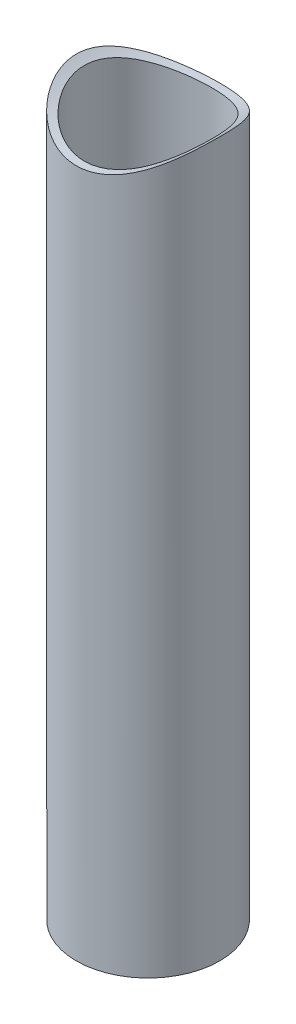
ISO-10303-21;
HEADER;
FILE_DESCRIPTION(('STEP AP214'),'2;1');
FILE_NAME('part.step','',(''),(''),'','','');
FILE_SCHEMA(('AUTOMOTIVE_DESIGN { 1 0 10303 214 1 1 1 1 }'));
ENDSEC;
DATA;
#1=APPLICATION_CONTEXT('core data for automotive mechanical design processes');
#2=APPLICATION_PROTOCOL_DEFINITION('international standard','automotive_design',2000,#1);
#3=PRODUCT_CONTEXT('',#1,'mechanical');
#4=PRODUCT('Part','Part','',(#3));
#5=PRODUCT_RELATED_PRODUCT_CATEGORY('part','',(#4));
#6=PRODUCT_DEFINITION_FORMATION('','',#4);
#7=PRODUCT_DEFINITION_CONTEXT('part definition',#1,'design');
#8=PRODUCT_DEFINITION('design','',#6,#7);
#9=PRODUCT_DEFINITION_SHAPE('','',#8);
#10=(LENGTH_UNIT() NAMED_UNIT(*) SI_UNIT(.MILLI.,.METRE.));
#11=(NAMED_UNIT(*) PLANE_ANGLE_UNIT() SI_UNIT($,.RADIAN.));
#12=(NAMED_UNIT(*) SI_UNIT($,.STERADIAN.) SOLID_ANGLE_UNIT());
#13=UNCERTAINTY_MEASURE_WITH_UNIT(LENGTH_MEASURE(1.E-05),#10,'distance_accuracy_value','');
#14=(GEOMETRIC_REPRESENTATION_CONTEXT(3) GLOBAL_UNCERTAINTY_ASSIGNED_CONTEXT((#13)) GLOBAL_UNIT_ASSIGNED_CONTEXT((#10,
#11,#12)) REPRESENTATION_CONTEXT('',''));
#15=CARTESIAN_POINT('',(0.,0.,0.));
#16=DIRECTION('',(0.,0.,1.));
#17=DIRECTION('',(1.,0.,0.));
#18=AXIS2_PLACEMENT_3D('',#15,#16,#17);
#19=CARTESIAN_POINT('',(0.,0.,0.));
#20=DIRECTION('',(0.,1.,0.));
#21=DIRECTION('',(0.,0.,1.));
#22=AXIS2_PLACEMENT_3D('',#19,#20,#21);
#23=PLANE('',#22);
#24=CARTESIAN_POINT('',(0.,0.,0.));
#25=DIRECTION('',(0.,1.,0.));
#26=DIRECTION('',(0.,0.,1.));
#27=AXIS2_PLACEMENT_3D('',#24,#25,#26);
#28=CIRCLE('',#27,7.9375);
#29=CARTESIAN_POINT('',(0.,0.,7.9375));
#30=VERTEX_POINT('',#29);
#31=EDGE_CURVE('E10',#30,#30,#28,.T.);
#32=ORIENTED_EDGE('',*,*,#31,.F.);
#33=EDGE_LOOP('',(#32));
#34=FACE_BOUND('',#33,.T.);
#35=CARTESIAN_POINT('',(0.,0.,0.));
#36=DIRECTION('',(0.,1.,0.));
#37=DIRECTION('',(0.,0.,1.));
#38=AXIS2_PLACEMENT_3D('',#35,#36,#37);
#39=CIRCLE('',#38,7.0485);
#40=CARTESIAN_POINT('',(0.,0.,7.0485));
#41=VERTEX_POINT('',#40);
#42=EDGE_CURVE('E46',#41,#41,#39,.T.);
#43=ORIENTED_EDGE('',*,*,#42,.T.);
#44=EDGE_LOOP('',(#43));
#45=FACE_BOUND('',#44,.T.);
#46=ADVANCED_FACE('F32',(#34,#45),#23,.F.);
#47=CARTESIAN_POINT('',(0.,88.9,0.));
#48=DIRECTION('',(0.,-1.,0.));
#49=DIRECTION('',(0.,0.,-1.));
#50=AXIS2_PLACEMENT_3D('',#47,#48,#49);
#51=CYLINDRICAL_SURFACE('',#50,7.9375);
#52=CARTESIAN_POINT('',(0.,76.2,-7.9375));
#53=CARTESIAN_POINT('',(0.201739041368471,76.2000004728503,-7.93749953499278));
#54=CARTESIAN_POINT('',(0.403488446576434,76.2048176230355,-7.92979870263526));
#55=CARTESIAN_POINT('',(0.805443060018179,76.2239686766591,-7.8991023844576));
#56=CARTESIAN_POINT('',(1.00564755898276,76.2383067154746,-7.87610025254355));
#57=CARTESIAN_POINT('',(1.40315814184426,76.2761706444708,-7.81508453956653));
#58=CARTESIAN_POINT('',(1.60045973896419,76.29970946626,-7.77704982952283));
#59=CARTESIAN_POINT('',(1.99053521067712,76.35541520527,-7.68646789068216));
#60=CARTESIAN_POINT('',(2.18330713262609,76.3875857718404,-7.63391452337359));
#61=CARTESIAN_POINT('',(2.56196376123141,76.4596106743845,-7.51527787325432));
#62=CARTESIAN_POINT('',(2.74788019033168,76.499422324321,-7.44926963308425));
#63=CARTESIAN_POINT('',(3.11296282478007,76.5859965712949,-7.3042433100681));
#64=CARTESIAN_POINT('',(3.29212638199121,76.6327618603719,-7.22522018734493));
#65=CARTESIAN_POINT('',(3.64269021438579,76.7322566825764,-7.0549739217575));
#66=CARTESIAN_POINT('',(3.81409509912127,76.7849826074947,-6.9637581535496));
#67=CARTESIAN_POINT('',(4.14861337783257,76.895413876922,-6.76981016401713));
#68=CARTESIAN_POINT('',(4.31172367627709,76.9531210590714,-6.66707368836082));
#69=CARTESIAN_POINT('',(4.81294866145539,77.1416342205612,-6.32543868247448));
#70=CARTESIAN_POINT('',(5.13503247600621,77.279717024903,-6.06661079060302));
#71=CARTESIAN_POINT('',(5.73404632799171,77.5632987111826,-5.50398780175486));
#72=CARTESIAN_POINT('',(6.01091462379353,77.7088073833193,-5.20013228125319));
#73=CARTESIAN_POINT('',(6.40636593989623,77.9329730937884,-4.69220024274917));
#74=CARTESIAN_POINT('',(6.54167320119787,78.0133657375114,-4.50169520891753));
#75=CARTESIAN_POINT('',(6.79568677227649,78.1700936295657,-4.10820920027474));
#76=CARTESIAN_POINT('',(6.91438997276443,78.2464281163087,-3.90522589899065));
#77=CARTESIAN_POINT('',(7.13401347491112,78.3922307030232,-3.4878780265806));
#78=CARTESIAN_POINT('',(7.23495774013726,78.461707999474,-3.27352930831123));
#79=CARTESIAN_POINT('',(7.41807462208145,78.5910357341303,-2.83419265944875));
#80=CARTESIAN_POINT('',(7.50025500789233,78.6508901535928,-2.60920917887078));
#81=CARTESIAN_POINT('',(7.62583887352565,78.7441636877437,-2.20958661829698));
#82=CARTESIAN_POINT('',(7.67377170148966,78.7804130963919,-2.03702003937505));
#83=CARTESIAN_POINT('',(7.75809620793248,78.8449133539286,-1.68763804361595));
#84=CARTESIAN_POINT('',(7.79449068321333,78.8731661409543,-1.51082366760551));
#85=CARTESIAN_POINT('',(7.85522342720327,78.9206736015007,-1.15414787294094));
#86=CARTESIAN_POINT('',(7.87957575318649,78.9399387651334,-0.974290261753216));
#87=CARTESIAN_POINT('',(7.91591648836484,78.9687961956645,-0.612546165554987));
#88=CARTESIAN_POINT('',(7.92790472814816,78.9783883300237,-0.430659652779134));
#89=CARTESIAN_POINT('',(7.93933187604833,78.9875298269265,-0.0657552660776738));
#90=CARTESIAN_POINT('',(7.93873752495498,78.9870525733501,0.117264327578585));
#91=CARTESIAN_POINT('',(7.92492809864643,78.976009331337,0.482517284842522));
#92=CARTESIAN_POINT('',(7.91171295819187,78.9654432907493,0.664750644381109));
#93=CARTESIAN_POINT('',(7.87286806727876,78.9346320399462,1.02717928073088));
#94=CARTESIAN_POINT('',(7.84722972621482,78.914380132109,1.2073730588109));
#95=CARTESIAN_POINT('',(7.78392567936421,78.8649560254577,1.56437831658882));
#96=CARTESIAN_POINT('',(7.74625970951021,78.8357836307944,1.74118972193616));
#97=CARTESIAN_POINT('',(7.66040790802239,78.7702916677712,2.08637284954481));
#98=CARTESIAN_POINT('',(7.61248647387731,78.7341536594987,2.25484520669524));
#99=CARTESIAN_POINT('',(7.50614440051444,78.6553833255514,2.58691330612416));
#100=CARTESIAN_POINT('',(7.44772020514098,78.6127488009525,2.75050737470939));
#101=CARTESIAN_POINT('',(7.25747941686762,78.4767904967193,3.23301636146897));
#102=CARTESIAN_POINT('',(7.11065079582381,78.3753771084986,3.54383146007847));
#103=CARTESIAN_POINT('',(6.74968610006634,78.1395963706601,4.19637403936481));
#104=CARTESIAN_POINT('',(6.52810038196324,78.002611997526,4.53302972024284));
#105=CARTESIAN_POINT('',(6.16066831196552,77.7934174575325,5.00902431475109));
#106=CARTESIAN_POINT('',(6.03223324047688,77.7230091294348,5.16296792737679));
#107=CARTESIAN_POINT('',(5.76399717035518,77.5823482175808,5.46080602972515));
#108=CARTESIAN_POINT('',(5.6241941730042,77.512095663453,5.60469874398706));
#109=CARTESIAN_POINT('',(5.30963244227627,77.3616716356376,5.90478278495736));
#110=CARTESIAN_POINT('',(5.13291711894878,77.2817820441986,6.05907031904445));
#111=CARTESIAN_POINT('',(4.76542385358572,77.1262781901502,6.35215327111168));
#112=CARTESIAN_POINT('',(4.57465109506246,77.0506623696328,6.49095435254102));
#113=CARTESIAN_POINT('',(4.17980536221483,76.9056908426482,6.75197270825118));
#114=CARTESIAN_POINT('',(3.97573221613199,76.8363352170516,6.87418976830651));
#115=CARTESIAN_POINT('',(3.55537666295463,76.7058330773724,7.10071717435151));
#116=CARTESIAN_POINT('',(3.33909570840597,76.6446855895573,7.20502964477509));
#117=CARTESIAN_POINT('',(2.90769946998035,76.5354504352621,7.38926185561915));
#118=CARTESIAN_POINT('',(2.6931507971941,76.4868361700353,7.47019396643397));
#119=CARTESIAN_POINT('',(2.25592151368444,76.3999809088183,7.61364865613235));
#120=CARTESIAN_POINT('',(2.03324105404608,76.3617397202119,7.67617157685525));
#121=CARTESIAN_POINT('',(1.58191912498485,76.2968478898773,7.78171449981311));
#122=CARTESIAN_POINT('',(1.35328499373077,76.2701836349815,7.82475741087987));
#123=CARTESIAN_POINT('',(0.892040639280498,76.2292528769654,7.89065342723416));
#124=CARTESIAN_POINT('',(0.65943110221138,76.2149842560458,7.91350998138035));
#125=CARTESIAN_POINT('',(0.227391919887281,76.2004784067146,7.93673818597211));
#126=CARTESIAN_POINT('',(0.0281675793366315,76.1984713662277,7.93994609714297));
#127=CARTESIAN_POINT('',(-0.369831100816882,76.2038266503345,7.93137681681763));
#128=CARTESIAN_POINT('',(-0.568605462587634,76.2111885028502,7.91960038034993));
#129=CARTESIAN_POINT('',(-0.964132789286348,76.2350994719283,7.88123309303378));
#130=CARTESIAN_POINT('',(-1.16088594911878,76.2516476940162,7.85464368451963));
#131=CARTESIAN_POINT('',(-1.55093994632036,76.2935309779087,7.78701944038209));
#132=CARTESIAN_POINT('',(-1.74424072273741,76.3188661946874,7.74598434998349));
#133=CARTESIAN_POINT('',(-2.11853172321314,76.3765715441998,7.65189452223095));
#134=CARTESIAN_POINT('',(-2.29970680807441,76.4086248555062,7.59937759450793));
#135=CARTESIAN_POINT('',(-2.65669551879437,76.4796494719918,7.4820580460772));
#136=CARTESIAN_POINT('',(-2.83250739477919,76.518623007358,7.41725146431225));
#137=CARTESIAN_POINT('',(-3.17781013983771,76.6027205634715,7.27600236673));
#138=CARTESIAN_POINT('',(-3.34730273526276,76.6478428885294,7.19956305826494));
#139=CARTESIAN_POINT('',(-3.67934207474231,76.743423781947,7.03567096646305));
#140=CARTESIAN_POINT('',(-3.84188626721929,76.7938842873439,6.94821418306189));
#141=CARTESIAN_POINT('',(-4.35009370138634,76.962582635168,6.6516260703067));
#142=CARTESIAN_POINT('',(-4.6814389192328,77.0894908638651,6.42242187998982));
#143=CARTESIAN_POINT('',(-5.30323518058702,77.3552895109652,5.91945435068259));
#144=CARTESIAN_POINT('',(-5.59364011807453,77.494193159013,5.64564151048665));
#145=CARTESIAN_POINT('',(-6.01533332752689,77.7135888003975,5.18377492062231));
#146=CARTESIAN_POINT('',(-6.16161637869311,77.793697223221,5.00902405345219));
#147=CARTESIAN_POINT('',(-6.43897528209487,77.9521628069094,4.64709912372846));
#148=CARTESIAN_POINT('',(-6.57004856143535,78.0305196696745,4.45992296769909));
#149=CARTESIAN_POINT('',(-6.93914755260477,78.2594310964116,3.8808997644976));
#150=CARTESIAN_POINT('',(-7.15355254202931,78.4040987850596,3.47101162945262));
#151=CARTESIAN_POINT('',(-7.47302041242335,78.6299373668107,2.7005893680761));
#152=CARTESIAN_POINT('',(-7.59158257265493,78.7180616897492,2.34772073021857));
#153=CARTESIAN_POINT('',(-7.73201627349787,78.8248176017812,1.80413256207854));
#154=CARTESIAN_POINT('',(-7.77258572070265,78.8561586318446,1.62061541729438));
#155=CARTESIAN_POINT('',(-7.84075654091829,78.90928264009,1.24977975093963));
#156=CARTESIAN_POINT('',(-7.86835795400166,78.9310656478073,1.06246124111749));
#157=CARTESIAN_POINT('',(-7.9102480110533,78.964271736675,0.684312945446909));
#158=CARTESIAN_POINT('',(-7.92445839109539,78.9756339030027,0.49346908369362));
#159=CARTESIAN_POINT('',(-7.93903274223715,78.9872884623143,0.110909988366785));
#160=CARTESIAN_POINT('',(-7.93939677439559,78.9875809041128,-0.0808052413605291));
#161=CARTESIAN_POINT('',(-7.92626891419433,78.9770806249616,-0.463508329200532));
#162=CARTESIAN_POINT('',(-7.91277281233079,78.9662845362802,-0.654495948641016));
#163=CARTESIAN_POINT('',(-7.87216544677196,78.9340741560227,-1.0340978913042));
#164=CARTESIAN_POINT('',(-7.84505437516811,78.9126600142551,-1.22271224797241));
#165=CARTESIAN_POINT('',(-7.78039679661611,78.8622235161899,-1.58105941210101));
#166=CARTESIAN_POINT('',(-7.74387197931695,78.8339568354482,-1.7510852712605));
#167=CARTESIAN_POINT('',(-7.66015013960237,78.7701004392687,-2.08710799889913));
#168=CARTESIAN_POINT('',(-7.61294955828487,78.734508282147,-2.25310350332707));
#169=CARTESIAN_POINT('',(-7.45605656918077,78.6182591821347,-2.74389938558109));
#170=CARTESIAN_POINT('',(-7.33104170015385,78.5281040556078,-3.06167864250887));
#171=CARTESIAN_POINT('',(-7.02326627827775,78.3168381382484,-3.71858241310545));
#172=CARTESIAN_POINT('',(-6.83476595879601,78.1931353921583,-4.05413685229279));
#173=CARTESIAN_POINT('',(-6.41347152197481,77.9355886042432,-4.69228119333398));
#174=CARTESIAN_POINT('',(-6.18064159435185,77.8017364164789,-4.99484413111009));
#175=CARTESIAN_POINT('',(-5.77569391220568,77.5880191676203,-5.44952756406373));
#176=CARTESIAN_POINT('',(-5.61660064645281,77.5079995358034,-5.61337366376787));
#177=CARTESIAN_POINT('',(-5.28426957717029,77.3500949556796,-5.92727854331289));
#178=CARTESIAN_POINT('',(-5.1110305203805,77.2722101973322,-6.07733609903576));
#179=CARTESIAN_POINT('',(-4.75098347114556,77.1205114461951,-6.36277262458991));
#180=CARTESIAN_POINT('',(-4.56416691225762,77.0467000760013,-6.49814219070813));
#181=CARTESIAN_POINT('',(-4.17780989523751,76.9050748014364,-6.75302630476872));
#182=CARTESIAN_POINT('',(-3.97826817197835,76.8372614949933,-6.87253927260913));
#183=CARTESIAN_POINT('',(-3.56704578084192,76.7093214771334,-7.09470320989308));
#184=CARTESIAN_POINT('',(-3.35534036839002,76.649211300305,-7.19731803802598));
#185=CARTESIAN_POINT('',(-2.92162024534505,76.538601363087,-7.38401902310277));
#186=CARTESIAN_POINT('',(-2.69961157936524,76.4880960542981,-7.46811588169563));
#187=CARTESIAN_POINT('',(-2.24750287628487,76.3983321630288,-7.61636899488247));
#188=CARTESIAN_POINT('',(-2.01742652180656,76.3590433258491,-7.68057893190415));
#189=CARTESIAN_POINT('',(-1.55084845588795,76.2928471272961,-7.78819732114139));
#190=CARTESIAN_POINT('',(-1.31435162007781,76.265930634478,-7.83162111561288));
#191=CARTESIAN_POINT('',(-0.898061516717918,76.2305338897998,-7.8885756236326));
#192=CARTESIAN_POINT('',(-0.719156625233639,76.2191048929041,-7.90690173667894));
#193=CARTESIAN_POINT('',(-0.360170623508275,76.2038375020409,-7.93136450964792));
#194=CARTESIAN_POINT('',(-0.180089441157222,76.1999995778936,-7.93750041510503));
#195=CARTESIAN_POINT('',(0.,76.2,-7.9375));
#196=B_SPLINE_CURVE_WITH_KNOTS('',3,(#52,#53,#54,#55,#56,#57,#58,#59,#60,#61,#62,#63,#64,#65,
#66,#67,#68,#69,#70,#71,#72,#73,#74,#75,#76,#77,#78,#79,#80,#81,#82,#83,#84,#85,#86,#87,#88,#89,
#90,#91,#92,#93,#94,#95,#96,#97,#98,#99,#100,#101,#102,#103,#104,#105,#106,#107,#108,#109,#110,
#111,#112,#113,#114,#115,#116,#117,#118,#119,#120,#121,#122,#123,#124,#125,#126,#127,#128,#129,
#130,#131,#132,#133,#134,#135,#136,#137,#138,#139,#140,#141,#142,#143,#144,#145,#146,#147,#148,
#149,#150,#151,#152,#153,#154,#155,#156,#157,#158,#159,#160,#161,#162,#163,#164,#165,#166,#167,
#168,#169,#170,#171,#172,#173,#174,#175,#176,#177,#178,#179,#180,#181,#182,#183,#184,#185,#186,
#187,#188,#189,#190,#191,#192,#193,#194,#195),.UNSPECIFIED.,.T.,.F.,(4,2,2,2,2,2,2,2,2,2,2,2,2,
2,2,2,2,2,2,2,2,2,2,2,2,2,2,2,2,2,2,2,2,2,2,2,2,2,2,2,2,2,2,2,2,2,2,2,2,2,2,2,2,2,2,2,2,2,2,2,2,
2,2,2,2,2,2,2,2,2,2,4),(0.,0.605032466965532,1.21032790051417,1.81647714760341,2.42288306882269,
3.0259951020022,3.62934123551352,4.23232407584534,4.83553032169086,6.13713310641447,
7.44049862716951,8.181056339442,8.92175254399169,9.66144147049492,10.4008235747676,
10.9484871921508,11.4960179586916,12.0429080532745,12.5898056412066,13.1381490082851,
13.6864952098747,14.2352211334837,14.7839591052322,15.319963521766,15.8561497683577,
16.9279807748438,18.2000370601928,18.8370734993811,19.4742221860236,20.2167821016984,
20.9590695643509,21.7013666146512,22.4435755281765,23.1457425675394,23.8478965675749,
24.5492226627341,25.2504289124566,25.8474483559121,26.4444377180554,27.0413689616944,
27.6383107338014,28.2117120916599,28.7852985766026,29.3587271989932,29.9323646167724,
31.1943593027149,32.4577640553729,33.1817121045419,33.9057824392656,35.3515833534236,
36.4943111364462,37.0653170546956,37.6363212084685,38.2106422690401,38.7849607970061,
39.3594538046143,39.9339387070196,40.4619467685538,40.990131108421,42.0459823290161,
43.2546905874606,44.4643794378768,45.1896481558809,45.9149811996373,46.6407759178751,
47.3666429069534,48.0940427464342,48.8210211073283,49.5460196181382,50.2704821791066,
50.8105522373992,51.3506557201891),.UNSPECIFIED.);
#197=CARTESIAN_POINT('',(0.,76.2,-7.9375));
#198=VERTEX_POINT('',#197);
#199=EDGE_CURVE('E50',#198,#198,#196,.T.);
#200=ORIENTED_EDGE('',*,*,#199,.T.);
#201=EDGE_LOOP('',(#200));
#202=FACE_BOUND('',#201,.T.);
#203=ORIENTED_EDGE('',*,*,#31,.T.);
#204=EDGE_LOOP('',(#203));
#205=FACE_BOUND('',#204,.T.);
#206=ADVANCED_FACE('F34',(#202,#205),#51,.T.);
#207=CARTESIAN_POINT('',(0.,88.9,0.));
#208=DIRECTION('',(0.,-1.,0.));
#209=DIRECTION('',(0.,0.,-1.));
#210=AXIS2_PLACEMENT_3D('',#207,#208,#209);
#211=CYLINDRICAL_SURFACE('',#210,7.0485);
#212=CARTESIAN_POINT('',(0.,76.2,-7.0485));
#213=CARTESIAN_POINT('',(0.182941782201594,76.1999995337118,-7.04850053218535));
#214=CARTESIAN_POINT('',(0.365876640929528,76.2039612400593,-7.04137003165967));
#215=CARTESIAN_POINT('',(0.730294252396065,76.2197031424221,-7.01294668502501));
#216=CARTESIAN_POINT('',(0.911777077194873,76.2314829479817,-6.99165454618426));
#217=CARTESIAN_POINT('',(1.27193540988049,76.2625612354059,-6.9351831702809));
#218=CARTESIAN_POINT('',(1.45061050347653,76.2818608162016,-6.90000190346731));
#219=CARTESIAN_POINT('',(1.80385191140284,76.3274965879735,-6.81618865333209));
#220=CARTESIAN_POINT('',(1.97841813228534,76.3538329388185,-6.76755636441503));
#221=CARTESIAN_POINT('',(2.32163162018639,76.4127978779366,-6.65760589447952));
#222=CARTESIAN_POINT('',(2.49029954854185,76.445401193601,-6.59633859631463));
#223=CARTESIAN_POINT('',(2.82150382584187,76.516226376835,-6.46161506944264));
#224=CARTESIAN_POINT('',(2.98403783362248,76.5544503629571,-6.38815424337956));
#225=CARTESIAN_POINT('',(3.46105509495003,76.676312349381,-6.15048901422132));
#226=CARTESIAN_POINT('',(3.76521927053737,76.7671879838532,-5.96891569303088));
#227=CARTESIAN_POINT('',(4.36048084642938,76.9676201842259,-5.55059035793831));
#228=CARTESIAN_POINT('',(4.64920365112904,77.0780358236694,-5.31088194942437));
#229=CARTESIAN_POINT('',(5.05052633040185,77.2465297779373,-4.92021262114861));
#230=CARTESIAN_POINT('',(5.17909977106984,77.3032207382781,-4.78468054011419));
#231=CARTESIAN_POINT('',(5.42519989944967,77.4162933810141,-4.50371208145303));
#232=CARTESIAN_POINT('',(5.54272468772968,77.4726750086673,-4.35827400821953));
#233=CARTESIAN_POINT('',(5.77744314566941,77.5893839748413,-4.04289078349403));
#234=CARTESIAN_POINT('',(5.89339755452663,77.6495325311888,-3.87195544698546));
#235=CARTESIAN_POINT('',(6.11037250424153,77.7658856237672,-3.51958792215367));
#236=CARTESIAN_POINT('',(6.21139435903687,77.822090506779,-3.33815665933963));
#237=CARTESIAN_POINT('',(6.39751990684712,77.9285267119067,-2.96586507972635));
#238=CARTESIAN_POINT('',(6.48264034786683,77.9787642984693,-2.77501495424503));
#239=CARTESIAN_POINT('',(6.63609519143386,78.071321268448,-2.3848481125914));
#240=CARTESIAN_POINT('',(6.70443468489977,78.1136430523891,-2.18553398576128));
#241=CARTESIAN_POINT('',(6.81086470731331,78.1806158005084,-1.82246439225638));
#242=CARTESIAN_POINT('',(6.85229340782435,78.2071112668412,-1.66002090354711));
#243=CARTESIAN_POINT('',(6.9236002127798,78.2531428357821,-1.33166155942276));
#244=CARTESIAN_POINT('',(6.95348063051376,78.2726803321117,-1.16574640645933));
#245=CARTESIAN_POINT('',(7.00130117595196,78.3041232844713,-0.831620298326207));
#246=CARTESIAN_POINT('',(7.01925094782589,78.3160349046115,-0.663411309918094));
#247=CARTESIAN_POINT('',(7.04300215811528,78.331824835043,-0.325753279202885));
#248=CARTESIAN_POINT('',(7.04880334183828,78.3357029769141,-0.156304210972523));
#249=CARTESIAN_POINT('',(7.04817186670077,78.3352816657665,0.182742882353627));
#250=CARTESIAN_POINT('',(7.04172605917906,78.3309734236507,0.352340871924084));
#251=CARTESIAN_POINT('',(7.01666818097641,78.31432139298,0.690233052741045));
#252=CARTESIAN_POINT('',(6.9980560699555,78.3019775777814,0.858527239662642));
#253=CARTESIAN_POINT('',(6.94891341921106,78.2696913039814,1.1926799838333));
#254=CARTESIAN_POINT('',(6.91837861204685,78.2497461247169,1.3585376469074));
#255=CARTESIAN_POINT('',(6.84576115929665,78.2029248535566,1.68676453249707));
#256=CARTESIAN_POINT('',(6.80367387325666,78.1760459767625,1.84913232486384));
#257=CARTESIAN_POINT('',(6.7084233484212,78.1162059153318,2.16940443279372));
#258=CARTESIAN_POINT('',(6.65526158987377,78.0832455436338,2.32730934167939));
#259=CARTESIAN_POINT('',(6.53834776308593,78.0121772376892,2.63797828881369));
#260=CARTESIAN_POINT('',(6.47459220533038,77.9740676080925,2.7907406131296));
#261=CARTESIAN_POINT('',(6.26819340087044,77.8535002317934,3.24034173580869));
#262=CARTESIAN_POINT('',(6.11037040587854,77.7647727825211,3.52865284733548));
#263=CARTESIAN_POINT('',(5.73109004792924,77.5643420679675,4.12037904114517));
#264=CARTESIAN_POINT('',(5.50361170751932,77.4511951481124,4.41945232870603));
#265=CARTESIAN_POINT('',(5.12933501359428,77.2811005818999,4.8380154106562));
#266=CARTESIAN_POINT('',(4.99896031729076,77.224298946489,4.97261479799116));
#267=CARTESIAN_POINT('',(4.72759672288195,77.1118120293967,5.23128137646062));
#268=CARTESIAN_POINT('',(4.58660609464981,77.0561269315633,5.3553468437936));
#269=CARTESIAN_POINT('',(4.27979717790139,76.9416222731503,5.6042455740198));
#270=CARTESIAN_POINT('',(4.11291088025142,76.8830571167859,5.72788199172881));
#271=CARTESIAN_POINT('',(3.76788017636557,76.7704497147615,5.96051145371805));
#272=CARTESIAN_POINT('',(3.58974046105845,76.7164056060779,6.06951054103736));
#273=CARTESIAN_POINT('',(3.22318305025424,76.6143468935572,6.27186224504223));
#274=CARTESIAN_POINT('',(3.03476789881471,76.5663308068982,6.36521871152545));
#275=CARTESIAN_POINT('',(2.64886963137842,76.4777352694938,6.53523373903351));
#276=CARTESIAN_POINT('',(2.45138762156283,76.4371549145682,6.61189433048012));
#277=CARTESIAN_POINT('',(2.06315232755182,76.3672627082515,6.74267658554425));
#278=CARTESIAN_POINT('',(1.8729147004327,76.3373559047221,6.79801091143738));
#279=CARTESIAN_POINT('',(1.48737392655304,76.2858996602948,6.89263806310568));
#280=CARTESIAN_POINT('',(1.29207097912715,76.2643498910547,6.93193151911871));
#281=CARTESIAN_POINT('',(0.898209256778737,76.2302618965338,6.99387479603163));
#282=CARTESIAN_POINT('',(0.699652979838059,76.2177170608265,7.01653682615953));
#283=CARTESIAN_POINT('',(0.300970291596672,76.202000177323,7.04490556325498));
#284=CARTESIAN_POINT('',(0.100844035962402,76.1988272117759,7.05061393042914));
#285=CARTESIAN_POINT('',(-0.276418689729305,76.2017696284542,7.0453107272255));
#286=CARTESIAN_POINT('',(-0.453592031298103,76.2068738042347,7.03611946978441));
#287=CARTESIAN_POINT('',(-0.806384587513013,76.2243962527775,7.00445986014873));
#288=CARTESIAN_POINT('',(-0.982003815591317,76.236814462262,6.98199162282097));
#289=CARTESIAN_POINT('',(-1.33042363387744,76.2686667777585,6.9240534042135));
#290=CARTESIAN_POINT('',(-1.50322432851009,76.2881006232258,6.8885839057702));
#291=CARTESIAN_POINT('',(-1.8448692229325,76.3335302959283,6.80505252036323));
#292=CARTESIAN_POINT('',(-2.01371329451065,76.3595263354862,6.75699022595185));
#293=CARTESIAN_POINT('',(-2.3458047556138,76.4173922632361,6.64897903503995));
#294=CARTESIAN_POINT('',(-2.50907062295386,76.44923994839,6.58907500682509));
#295=CARTESIAN_POINT('',(-2.82981307485206,76.518194318504,6.45782998552905));
#296=CARTESIAN_POINT('',(-2.9872877498301,76.5553027188869,6.38648526084724));
#297=CARTESIAN_POINT('',(-3.44978840983169,76.6733903720233,6.15620102339934));
#298=CARTESIAN_POINT('',(-3.74511284552596,76.7611722724692,5.98093847681275));
#299=CARTESIAN_POINT('',(-4.33371561367475,76.9578503813208,5.5715154928445));
#300=CARTESIAN_POINT('',(-4.62364673362104,77.0679902472735,5.33314671342961));
#301=CARTESIAN_POINT('',(-5.02687617811155,77.2363009736987,4.94437479345244));
#302=CARTESIAN_POINT('',(-5.1561068784596,77.2929721054288,4.80944981546941));
#303=CARTESIAN_POINT('',(-5.40355321316058,77.4060846510437,4.52966083509027));
#304=CARTESIAN_POINT('',(-5.52176702707383,77.4625260254949,4.38479519693359));
#305=CARTESIAN_POINT('',(-5.75788294972512,77.579406013256,4.07069182637545));
#306=CARTESIAN_POINT('',(-5.87455890670284,77.6396760217934,3.90046804268954));
#307=CARTESIAN_POINT('',(-6.09304318058961,77.7563845861835,3.54949231169106));
#308=CARTESIAN_POINT('',(-6.19485277130319,77.8128234700789,3.36874126825118));
#309=CARTESIAN_POINT('',(-6.38262657273456,77.9198474357589,2.99776659720515));
#310=CARTESIAN_POINT('',(-6.46860735793888,77.9704386198202,2.80755314602827));
#311=CARTESIAN_POINT('',(-6.6238614624182,78.0638254591417,2.41859928248053));
#312=CARTESIAN_POINT('',(-6.69313978511952,78.1066234480061,2.21986144475944));
#313=CARTESIAN_POINT('',(-6.80141505709699,78.1746123472644,1.85743241897961));
#314=CARTESIAN_POINT('',(-6.84371360558953,78.2016138704853,1.69506063309393));
#315=CARTESIAN_POINT('',(-6.91675980105691,78.2486935875729,1.36676572226932));
#316=CARTESIAN_POINT('',(-6.94750976570939,78.2687731705326,1.20084331697433));
#317=CARTESIAN_POINT('',(-6.99705950317286,78.3013189657895,0.866618151937024));
#318=CARTESIAN_POINT('',(-7.01586902246271,78.313791387163,0.698317448519527));
#319=CARTESIAN_POINT('',(-7.04131963391212,78.3307023062543,0.360387457963778));
#320=CARTESIAN_POINT('',(-7.04796048276473,78.3351406433344,0.190758144328679));
#321=CARTESIAN_POINT('',(-7.04897695636216,78.335818800176,-0.148759576059127));
#322=CARTESIAN_POINT('',(-7.04333770257756,78.3320486745938,-0.31864804761557));
#323=CARTESIAN_POINT('',(-7.01984580609174,78.3164296399902,-0.657199584711332));
#324=CARTESIAN_POINT('',(-7.00199312250229,78.3045807039226,-0.825862646146302));
#325=CARTESIAN_POINT('',(-6.95431406675788,78.2732259684225,-1.16081766136174));
#326=CARTESIAN_POINT('',(-6.92448351381728,78.2537174955388,-1.32710876622027));
#327=CARTESIAN_POINT('',(-6.85321419670674,78.2077013472045,-1.65625423656442));
#328=CARTESIAN_POINT('',(-6.81177076726156,78.18119085906,-1.81910719249944));
#329=CARTESIAN_POINT('',(-6.71788223178925,78.1221003281931,-2.13992033805113));
#330=CARTESIAN_POINT('',(-6.66547088295119,78.0895389426551,-2.29789387205735));
#331=CARTESIAN_POINT('',(-6.55005757652071,78.019223021289,-2.60875636502339));
#332=CARTESIAN_POINT('',(-6.48705213194855,77.9814667763518,-2.76164362995819));
#333=CARTESIAN_POINT('',(-6.28290160121854,77.8618824136808,-3.21169387573107));
#334=CARTESIAN_POINT('',(-6.12657480899256,77.7737074617713,-3.50040564337752));
#335=CARTESIAN_POINT('',(-5.75071267921597,77.5743242477042,-4.09287262606965));
#336=CARTESIAN_POINT('',(-5.52520467268081,77.4616467926873,-4.392349709737));
#337=CARTESIAN_POINT('',(-5.15394234477777,77.2920065942499,-4.81177513013584));
#338=CARTESIAN_POINT('',(-5.02458189737422,77.2353143342302,-4.94670597589686));
#339=CARTESIAN_POINT('',(-4.75526378459548,77.1229575206713,-5.20612749223533));
#340=CARTESIAN_POINT('',(-4.61530438200226,77.0672931374737,-5.33061644425973));
#341=CARTESIAN_POINT('',(-4.31031501230734,76.9525980021623,-5.58080451177332));
#342=CARTESIAN_POINT('',(-4.14419081903276,76.8938178080902,-5.70528723792267));
#343=CARTESIAN_POINT('',(-3.80063234810095,76.7806814747235,-5.93967707531035));
#344=CARTESIAN_POINT('',(-3.62320274649129,76.726323527247,-6.04959015551832));
#345=CARTESIAN_POINT('',(-3.2580160984135,76.6235470820694,-6.25383360504267));
#346=CARTESIAN_POINT('',(-3.07026243751948,76.5751266539012,-6.34816904259798));
#347=CARTESIAN_POINT('',(-2.68560938223532,76.4856344814811,-6.52021658262602));
#348=CARTESIAN_POINT('',(-2.48871130492942,76.444561683048,-6.59793107005737));
#349=CARTESIAN_POINT('',(-2.10600993744165,76.3744676131661,-6.72927181607155));
#350=CARTESIAN_POINT('',(-1.92088568341848,76.3446794336007,-6.7844690864731));
#351=CARTESIAN_POINT('',(-1.54568468908035,76.2929897949014,-6.87965543190829));
#352=CARTESIAN_POINT('',(-1.355608265728,76.2710878323351,-6.9196454777346));
#353=CARTESIAN_POINT('',(-0.972148660900587,76.2357995130935,-6.98384173660576));
#354=CARTESIAN_POINT('',(-0.778767675644312,76.2224077105284,-7.00805804395633));
#355=CARTESIAN_POINT('',(-0.39025511427604,76.2045084067916,-7.04038652180539));
#356=CARTESIAN_POINT('',(-0.195123619027299,76.2000004973377,-7.04849943237718));
#357=CARTESIAN_POINT('',(0.,76.2,-7.0485));
#358=B_SPLINE_CURVE_WITH_KNOTS('',3,(#212,#213,#214,#215,#216,#217,#218,#219,#220,#221,#222,
#223,#224,#225,#226,#227,#228,#229,#230,#231,#232,#233,#234,#235,#236,#237,#238,#239,#240,#241,
#242,#243,#244,#245,#246,#247,#248,#249,#250,#251,#252,#253,#254,#255,#256,#257,#258,#259,#260,
#261,#262,#263,#264,#265,#266,#267,#268,#269,#270,#271,#272,#273,#274,#275,#276,#277,#278,#279,
#280,#281,#282,#283,#284,#285,#286,#287,#288,#289,#290,#291,#292,#293,#294,#295,#296,#297,#298,
#299,#300,#301,#302,#303,#304,#305,#306,#307,#308,#309,#310,#311,#312,#313,#314,#315,#316,#317,
#318,#319,#320,#321,#322,#323,#324,#325,#326,#327,#328,#329,#330,#331,#332,#333,#334,#335,#336,
#337,#338,#339,#340,#341,#342,#343,#344,#345,#346,#347,#348,#349,#350,#351,#352,#353,#354,#355,
#356,#357),.UNSPECIFIED.,.T.,.F.,(4,2,2,2,2,2,2,2,2,2,2,2,2,2,2,2,2,2,2,2,2,2,2,2,2,2,2,2,2,2,2,
2,2,2,2,2,2,2,2,2,2,2,2,2,2,2,2,2,2,2,2,2,2,2,2,2,2,2,2,2,2,2,2,2,2,2,2,2,2,2,2,2,4),(0.,
0.54863296509801,1.09723853212759,1.64592430182582,2.19462253820704,2.74115279546702,
3.28788958239784,4.38052287100362,5.54904017819708,6.13426394057591,6.71958812856495,
7.36419875958947,8.00875263655813,8.65262376821098,9.29629932350909,9.80494291101854,
10.3134845569214,10.8216146202428,11.3297553362921,11.8384419125951,12.3471301755648,
12.8560006783404,13.3650758864942,13.8740830936999,14.3832582975044,15.4011094260927,
16.5733431844061,17.1603069334507,17.7473665505764,18.3939314692482,19.0402286267482,
19.6863664900003,20.332425731086,20.9326787894912,21.5329082619791,22.1326966604932,
22.7324263221135,23.2642368705582,23.79604281807,24.3278290175546,24.8596324254364,
25.3894581752448,25.9194570906169,26.9787517533906,28.1472104699078,28.732460613817,
29.3178072941221,29.9620016480339,30.6061407725918,31.2496015284528,31.892869287624,
32.4021901228767,32.911408688179,33.4202110636958,33.9290236123704,34.4384529795155,
34.9478840521412,35.4574930926539,35.967307154153,36.4755745934112,36.984009654343,
38.0003745271422,39.1697415777453,39.7552787780182,40.3409121591492,40.9873510566103,
41.6335242936051,42.2794868799451,42.9253567141154,43.5109617633319,44.0965294226517,
44.6817219824743,45.2668876476346),.UNSPECIFIED.);
#359=CARTESIAN_POINT('',(0.,76.2,-7.0485));
#360=VERTEX_POINT('',#359);
#361=EDGE_CURVE('E37',#360,#360,#358,.T.);
#362=ORIENTED_EDGE('',*,*,#361,.F.);
#363=EDGE_LOOP('',(#362));
#364=FACE_BOUND('',#363,.T.);
#365=ORIENTED_EDGE('',*,*,#42,.F.);
#366=EDGE_LOOP('',(#365));
#367=FACE_BOUND('',#366,.T.);
#368=ADVANCED_FACE('F60',(#364,#367),#211,.F.);
#369=CARTESIAN_POINT('',(0.,88.9,-7.9375));
#370=DIRECTION('',(0.,0.,1.));
#371=DIRECTION('',(1.,0.,0.));
#372=AXIS2_PLACEMENT_3D('',#369,#370,#371);
#373=CYLINDRICAL_SURFACE('',#372,12.7);
#374=ORIENTED_EDGE('',*,*,#361,.T.);
#375=EDGE_LOOP('',(#374));
#376=FACE_BOUND('',#375,.T.);
#377=ORIENTED_EDGE('',*,*,#199,.F.);
#378=EDGE_LOOP('',(#377));
#379=FACE_BOUND('',#378,.T.);
#380=ADVANCED_FACE('F57',(#376,#379),#373,.F.);
#381=CLOSED_SHELL('',(#46,#206,#368,#380));
#382=MANIFOLD_SOLID_BREP('B2',#381);
#383=ADVANCED_BREP_SHAPE_REPRESENTATION('',(#18,#382),#14);
#384=SHAPE_DEFINITION_REPRESENTATION(#9,#383);
ENDSEC;
END-ISO-10303-21;
